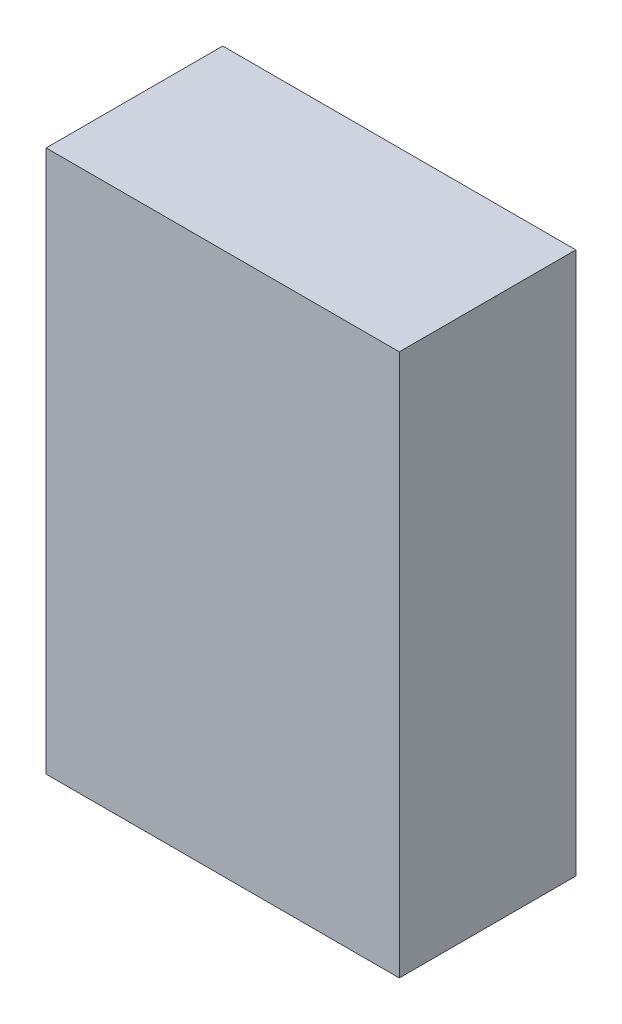
ISO-10303-21;
HEADER;
FILE_DESCRIPTION(('STEP AP214'),'2;1');
FILE_NAME('part.step','',(''),(''),'','','');
FILE_SCHEMA(('AUTOMOTIVE_DESIGN { 1 0 10303 214 1 1 1 1 }'));
ENDSEC;
DATA;
#1=APPLICATION_CONTEXT('core data for automotive mechanical design processes');
#2=APPLICATION_PROTOCOL_DEFINITION('international standard','automotive_design',2000,#1);
#3=PRODUCT_CONTEXT('',#1,'mechanical');
#4=PRODUCT('Part','Part','',(#3));
#5=PRODUCT_RELATED_PRODUCT_CATEGORY('part','',(#4));
#6=PRODUCT_DEFINITION_FORMATION('','',#4);
#7=PRODUCT_DEFINITION_CONTEXT('part definition',#1,'design');
#8=PRODUCT_DEFINITION('design','',#6,#7);
#9=PRODUCT_DEFINITION_SHAPE('','',#8);
#10=(LENGTH_UNIT() NAMED_UNIT(*) SI_UNIT(.MILLI.,.METRE.));
#11=(NAMED_UNIT(*) PLANE_ANGLE_UNIT() SI_UNIT($,.RADIAN.));
#12=(NAMED_UNIT(*) SI_UNIT($,.STERADIAN.) SOLID_ANGLE_UNIT());
#13=UNCERTAINTY_MEASURE_WITH_UNIT(LENGTH_MEASURE(1.E-05),#10,'distance_accuracy_value','');
#14=(GEOMETRIC_REPRESENTATION_CONTEXT(3) GLOBAL_UNCERTAINTY_ASSIGNED_CONTEXT((#13)) GLOBAL_UNIT_ASSIGNED_CONTEXT((#10,
#11,#12)) REPRESENTATION_CONTEXT('',''));
#15=CARTESIAN_POINT('',(0.,0.,0.));
#16=DIRECTION('',(0.,0.,1.));
#17=DIRECTION('',(1.,0.,0.));
#18=AXIS2_PLACEMENT_3D('',#15,#16,#17);
#19=CARTESIAN_POINT('',(-0.70000114,1.07499912,0.));
#20=DIRECTION('',(1.,0.,0.));
#21=DIRECTION('',(0.,-1.,0.));
#22=AXIS2_PLACEMENT_3D('',#19,#20,#21);
#23=PLANE('',#22);
#24=DIRECTION('',(0.,-1.,0.));
#25=VECTOR('',#24,1.);
#26=CARTESIAN_POINT('',(-0.70000114,1.07499912,0.));
#27=LINE('',#26,#25);
#28=CARTESIAN_POINT('',(-0.70000114,1.07499912,0.));
#29=VERTEX_POINT('',#28);
#30=CARTESIAN_POINT('',(-0.70000114,-1.07499912,0.));
#31=VERTEX_POINT('',#30);
#32=EDGE_CURVE('E11',#29,#31,#27,.T.);
#33=ORIENTED_EDGE('',*,*,#32,.T.);
#34=DIRECTION('',(0.,0.,1.));
#35=VECTOR('',#34,1.);
#36=CARTESIAN_POINT('',(-0.70000114,-1.07499912,0.));
#37=LINE('',#36,#35);
#38=CARTESIAN_POINT('',(-0.70000114,-1.07499912,0.70000114));
#39=VERTEX_POINT('',#38);
#40=EDGE_CURVE('E24',#31,#39,#37,.T.);
#41=ORIENTED_EDGE('',*,*,#40,.T.);
#42=DIRECTION('',(0.,-1.,0.));
#43=VECTOR('',#42,1.);
#44=CARTESIAN_POINT('',(-0.70000114,1.07499912,0.70000114));
#45=LINE('',#44,#43);
#46=CARTESIAN_POINT('',(-0.70000114,1.07499912,0.70000114));
#47=VERTEX_POINT('',#46);
#48=EDGE_CURVE('E87',#47,#39,#45,.T.);
#49=ORIENTED_EDGE('',*,*,#48,.F.);
#50=DIRECTION('',(0.,0.,1.));
#51=VECTOR('',#50,1.);
#52=CARTESIAN_POINT('',(-0.70000114,1.07499912,0.));
#53=LINE('',#52,#51);
#54=EDGE_CURVE('E36',#29,#47,#53,.T.);
#55=ORIENTED_EDGE('',*,*,#54,.F.);
#56=EDGE_LOOP('',(#33,#41,#49,#55));
#57=FACE_BOUND('',#56,.T.);
#58=ADVANCED_FACE('F17',(#57),#23,.F.);
#59=CARTESIAN_POINT('',(-0.70000114,-1.07499912,0.));
#60=DIRECTION('',(0.,1.,0.));
#61=DIRECTION('',(1.,0.,0.));
#62=AXIS2_PLACEMENT_3D('',#59,#60,#61);
#63=PLANE('',#62);
#64=DIRECTION('',(1.,0.,0.));
#65=VECTOR('',#64,1.);
#66=CARTESIAN_POINT('',(-0.70000114,-1.07499912,0.));
#67=LINE('',#66,#65);
#68=CARTESIAN_POINT('',(0.70000114,-1.07499912,0.));
#69=VERTEX_POINT('',#68);
#70=EDGE_CURVE('E84',#31,#69,#67,.T.);
#71=ORIENTED_EDGE('',*,*,#70,.T.);
#72=DIRECTION('',(0.,0.,1.));
#73=VECTOR('',#72,1.);
#74=CARTESIAN_POINT('',(0.70000114,-1.07499912,0.));
#75=LINE('',#74,#73);
#76=CARTESIAN_POINT('',(0.70000114,-1.07499912,0.70000114));
#77=VERTEX_POINT('',#76);
#78=EDGE_CURVE('E82',#69,#77,#75,.T.);
#79=ORIENTED_EDGE('',*,*,#78,.T.);
#80=DIRECTION('',(1.,0.,0.));
#81=VECTOR('',#80,1.);
#82=CARTESIAN_POINT('',(-0.70000114,-1.07499912,0.70000114));
#83=LINE('',#82,#81);
#84=EDGE_CURVE('E62',#39,#77,#83,.T.);
#85=ORIENTED_EDGE('',*,*,#84,.F.);
#86=ORIENTED_EDGE('',*,*,#40,.F.);
#87=EDGE_LOOP('',(#71,#79,#85,#86));
#88=FACE_BOUND('',#87,.T.);
#89=ADVANCED_FACE('F89',(#88),#63,.F.);
#90=CARTESIAN_POINT('',(0.70000114,-1.07499912,0.));
#91=DIRECTION('',(-1.,0.,0.));
#92=DIRECTION('',(0.,1.,0.));
#93=AXIS2_PLACEMENT_3D('',#90,#91,#92);
#94=PLANE('',#93);
#95=DIRECTION('',(0.,1.,0.));
#96=VECTOR('',#95,1.);
#97=CARTESIAN_POINT('',(0.70000114,-1.07499912,0.));
#98=LINE('',#97,#96);
#99=CARTESIAN_POINT('',(0.70000114,1.07499912,0.));
#100=VERTEX_POINT('',#99);
#101=EDGE_CURVE('E71',#69,#100,#98,.T.);
#102=ORIENTED_EDGE('',*,*,#101,.T.);
#103=DIRECTION('',(0.,0.,1.));
#104=VECTOR('',#103,1.);
#105=CARTESIAN_POINT('',(0.70000114,1.07499912,0.));
#106=LINE('',#105,#104);
#107=CARTESIAN_POINT('',(0.70000114,1.07499912,0.70000114));
#108=VERTEX_POINT('',#107);
#109=EDGE_CURVE('E65',#100,#108,#106,.T.);
#110=ORIENTED_EDGE('',*,*,#109,.T.);
#111=DIRECTION('',(0.,1.,0.));
#112=VECTOR('',#111,1.);
#113=CARTESIAN_POINT('',(0.70000114,-1.07499912,0.70000114));
#114=LINE('',#113,#112);
#115=EDGE_CURVE('E57',#77,#108,#114,.T.);
#116=ORIENTED_EDGE('',*,*,#115,.F.);
#117=ORIENTED_EDGE('',*,*,#78,.F.);
#118=EDGE_LOOP('',(#102,#110,#116,#117));
#119=FACE_BOUND('',#118,.T.);
#120=ADVANCED_FACE('F69',(#119),#94,.F.);
#121=CARTESIAN_POINT('',(0.70000114,1.07499912,0.));
#122=DIRECTION('',(0.,-1.,0.));
#123=DIRECTION('',(-1.,0.,0.));
#124=AXIS2_PLACEMENT_3D('',#121,#122,#123);
#125=PLANE('',#124);
#126=DIRECTION('',(-1.,0.,0.));
#127=VECTOR('',#126,1.);
#128=CARTESIAN_POINT('',(0.70000114,1.07499912,0.));
#129=LINE('',#128,#127);
#130=EDGE_CURVE('E66',#100,#29,#129,.T.);
#131=ORIENTED_EDGE('',*,*,#130,.T.);
#132=ORIENTED_EDGE('',*,*,#54,.T.);
#133=DIRECTION('',(-1.,0.,0.));
#134=VECTOR('',#133,1.);
#135=CARTESIAN_POINT('',(0.70000114,1.07499912,0.70000114));
#136=LINE('',#135,#134);
#137=EDGE_CURVE('E61',#108,#47,#136,.T.);
#138=ORIENTED_EDGE('',*,*,#137,.F.);
#139=ORIENTED_EDGE('',*,*,#109,.F.);
#140=EDGE_LOOP('',(#131,#132,#138,#139));
#141=FACE_BOUND('',#140,.T.);
#142=ADVANCED_FACE('F76',(#141),#125,.F.);
#143=CARTESIAN_POINT('',(-0.70000114,1.07499912,0.));
#144=DIRECTION('',(0.,0.,-1.));
#145=DIRECTION('',(-1.,0.,0.));
#146=AXIS2_PLACEMENT_3D('',#143,#144,#145);
#147=PLANE('',#146);
#148=ORIENTED_EDGE('',*,*,#130,.F.);
#149=ORIENTED_EDGE('',*,*,#101,.F.);
#150=ORIENTED_EDGE('',*,*,#70,.F.);
#151=ORIENTED_EDGE('',*,*,#32,.F.);
#152=EDGE_LOOP('',(#148,#149,#150,#151));
#153=FACE_BOUND('',#152,.T.);
#154=ADVANCED_FACE('F91',(#153),#147,.T.);
#155=CARTESIAN_POINT('',(-0.70000114,1.07499912,0.70000114));
#156=DIRECTION('',(0.,0.,-1.));
#157=DIRECTION('',(-1.,0.,0.));
#158=AXIS2_PLACEMENT_3D('',#155,#156,#157);
#159=PLANE('',#158);
#160=ORIENTED_EDGE('',*,*,#48,.T.);
#161=ORIENTED_EDGE('',*,*,#84,.T.);
#162=ORIENTED_EDGE('',*,*,#115,.T.);
#163=ORIENTED_EDGE('',*,*,#137,.T.);
#164=EDGE_LOOP('',(#160,#161,#162,#163));
#165=FACE_BOUND('',#164,.T.);
#166=ADVANCED_FACE('F59',(#165),#159,.F.);
#167=CLOSED_SHELL('',(#58,#89,#120,#142,#154,#166));
#168=MANIFOLD_SOLID_BREP('B1',#167);
#169=ADVANCED_BREP_SHAPE_REPRESENTATION('',(#18,#168),#14);
#170=SHAPE_DEFINITION_REPRESENTATION(#9,#169);
ENDSEC;
END-ISO-10303-21;
